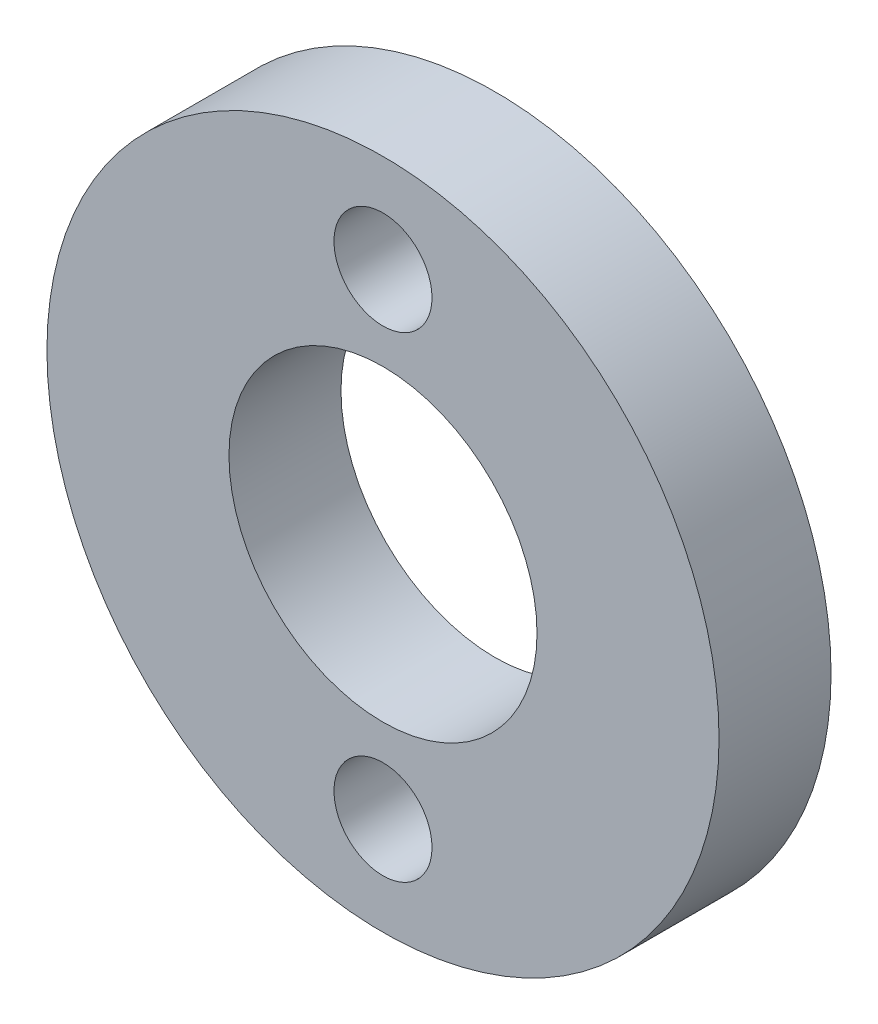
ISO-10303-21;
HEADER;
FILE_DESCRIPTION(('STEP AP214'),'2;1');
FILE_NAME('part.step','',(''),(''),'','','');
FILE_SCHEMA(('AUTOMOTIVE_DESIGN { 1 0 10303 214 1 1 1 1 }'));
ENDSEC;
DATA;
#1=APPLICATION_CONTEXT('core data for automotive mechanical design processes');
#2=APPLICATION_PROTOCOL_DEFINITION('international standard','automotive_design',2000,#1);
#3=PRODUCT_CONTEXT('',#1,'mechanical');
#4=PRODUCT('Part','Part','',(#3));
#5=PRODUCT_RELATED_PRODUCT_CATEGORY('part','',(#4));
#6=PRODUCT_DEFINITION_FORMATION('','',#4);
#7=PRODUCT_DEFINITION_CONTEXT('part definition',#1,'design');
#8=PRODUCT_DEFINITION('design','',#6,#7);
#9=PRODUCT_DEFINITION_SHAPE('','',#8);
#10=(LENGTH_UNIT() NAMED_UNIT(*) SI_UNIT(.MILLI.,.METRE.));
#11=(NAMED_UNIT(*) PLANE_ANGLE_UNIT() SI_UNIT($,.RADIAN.));
#12=(NAMED_UNIT(*) SI_UNIT($,.STERADIAN.) SOLID_ANGLE_UNIT());
#13=UNCERTAINTY_MEASURE_WITH_UNIT(LENGTH_MEASURE(1.E-05),#10,'distance_accuracy_value','');
#14=(GEOMETRIC_REPRESENTATION_CONTEXT(3) GLOBAL_UNCERTAINTY_ASSIGNED_CONTEXT((#13)) GLOBAL_UNIT_ASSIGNED_CONTEXT((#10,
#11,#12)) REPRESENTATION_CONTEXT('',''));
#15=CARTESIAN_POINT('',(0.,0.,0.));
#16=DIRECTION('',(0.,0.,1.));
#17=DIRECTION('',(1.,0.,0.));
#18=AXIS2_PLACEMENT_3D('',#15,#16,#17);
#19=CARTESIAN_POINT('',(0.,0.,4.));
#20=DIRECTION('',(0.,0.,1.));
#21=DIRECTION('',(1.,0.,0.));
#22=AXIS2_PLACEMENT_3D('',#19,#20,#21);
#23=PLANE('',#22);
#24=CARTESIAN_POINT('',(0.,8.5,4.));
#25=DIRECTION('',(0.,0.,1.));
#26=DIRECTION('',(1.,0.,0.));
#27=AXIS2_PLACEMENT_3D('',#24,#25,#26);
#28=CIRCLE('',#27,1.75);
#29=CARTESIAN_POINT('',(1.75,8.5,4.));
#30=VERTEX_POINT('',#29);
#31=EDGE_CURVE('E58',#30,#30,#28,.T.);
#32=ORIENTED_EDGE('',*,*,#31,.F.);
#33=EDGE_LOOP('',(#32));
#34=FACE_BOUND('',#33,.T.);
#35=CARTESIAN_POINT('',(0.,0.,4.));
#36=DIRECTION('',(0.,0.,1.));
#37=DIRECTION('',(1.,0.,0.));
#38=AXIS2_PLACEMENT_3D('',#35,#36,#37);
#39=CIRCLE('',#38,12.);
#40=CARTESIAN_POINT('',(12.,0.,4.));
#41=VERTEX_POINT('',#40);
#42=EDGE_CURVE('E12',#41,#41,#39,.T.);
#43=ORIENTED_EDGE('',*,*,#42,.T.);
#44=EDGE_LOOP('',(#43));
#45=FACE_BOUND('',#44,.T.);
#46=CARTESIAN_POINT('',(0.,0.,4.));
#47=DIRECTION('',(0.,0.,1.));
#48=DIRECTION('',(1.,0.,0.));
#49=AXIS2_PLACEMENT_3D('',#46,#47,#48);
#50=CIRCLE('',#49,5.5);
#51=CARTESIAN_POINT('',(5.5,0.,4.));
#52=VERTEX_POINT('',#51);
#53=EDGE_CURVE('E53',#52,#52,#50,.T.);
#54=ORIENTED_EDGE('',*,*,#53,.F.);
#55=EDGE_LOOP('',(#54));
#56=FACE_BOUND('',#55,.T.);
#57=CARTESIAN_POINT('',(0.,-8.5,4.));
#58=DIRECTION('',(0.,0.,1.));
#59=DIRECTION('',(1.,0.,0.));
#60=AXIS2_PLACEMENT_3D('',#57,#58,#59);
#61=CIRCLE('',#60,1.75);
#62=CARTESIAN_POINT('',(1.75,-8.5,4.));
#63=VERTEX_POINT('',#62);
#64=EDGE_CURVE('E64',#63,#63,#61,.T.);
#65=ORIENTED_EDGE('',*,*,#64,.F.);
#66=EDGE_LOOP('',(#65));
#67=FACE_BOUND('',#66,.T.);
#68=ADVANCED_FACE('F42',(#34,#45,#56,#67),#23,.T.);
#69=CARTESIAN_POINT('',(0.,0.,0.));
#70=DIRECTION('',(0.,0.,1.));
#71=DIRECTION('',(1.,0.,0.));
#72=AXIS2_PLACEMENT_3D('',#69,#70,#71);
#73=PLANE('',#72);
#74=CARTESIAN_POINT('',(0.,0.,0.));
#75=DIRECTION('',(0.,0.,1.));
#76=DIRECTION('',(1.,0.,0.));
#77=AXIS2_PLACEMENT_3D('',#74,#75,#76);
#78=CIRCLE('',#77,12.);
#79=CARTESIAN_POINT('',(12.,0.,0.));
#80=VERTEX_POINT('',#79);
#81=EDGE_CURVE('E46',#80,#80,#78,.T.);
#82=ORIENTED_EDGE('',*,*,#81,.F.);
#83=EDGE_LOOP('',(#82));
#84=FACE_BOUND('',#83,.T.);
#85=CARTESIAN_POINT('',(0.,0.,0.));
#86=DIRECTION('',(0.,0.,1.));
#87=DIRECTION('',(1.,0.,0.));
#88=AXIS2_PLACEMENT_3D('',#85,#86,#87);
#89=CIRCLE('',#88,5.5);
#90=CARTESIAN_POINT('',(5.5,0.,0.));
#91=VERTEX_POINT('',#90);
#92=EDGE_CURVE('E55',#91,#91,#89,.T.);
#93=ORIENTED_EDGE('',*,*,#92,.T.);
#94=EDGE_LOOP('',(#93));
#95=FACE_BOUND('',#94,.T.);
#96=CARTESIAN_POINT('',(0.,8.5,0.));
#97=DIRECTION('',(0.,0.,1.));
#98=DIRECTION('',(1.,0.,0.));
#99=AXIS2_PLACEMENT_3D('',#96,#97,#98);
#100=CIRCLE('',#99,1.75);
#101=CARTESIAN_POINT('',(1.75,8.5,0.));
#102=VERTEX_POINT('',#101);
#103=EDGE_CURVE('E61',#102,#102,#100,.T.);
#104=ORIENTED_EDGE('',*,*,#103,.T.);
#105=EDGE_LOOP('',(#104));
#106=FACE_BOUND('',#105,.T.);
#107=CARTESIAN_POINT('',(0.,-8.5,0.));
#108=DIRECTION('',(0.,0.,1.));
#109=DIRECTION('',(1.,0.,0.));
#110=AXIS2_PLACEMENT_3D('',#107,#108,#109);
#111=CIRCLE('',#110,1.75);
#112=CARTESIAN_POINT('',(1.75,-8.5,0.));
#113=VERTEX_POINT('',#112);
#114=EDGE_CURVE('E67',#113,#113,#111,.T.);
#115=ORIENTED_EDGE('',*,*,#114,.T.);
#116=EDGE_LOOP('',(#115));
#117=FACE_BOUND('',#116,.T.);
#118=ADVANCED_FACE('F77',(#84,#95,#106,#117),#73,.F.);
#119=CARTESIAN_POINT('',(0.,0.,4.));
#120=DIRECTION('',(0.,0.,-1.));
#121=DIRECTION('',(-1.,0.,0.));
#122=AXIS2_PLACEMENT_3D('',#119,#120,#121);
#123=CYLINDRICAL_SURFACE('',#122,12.);
#124=ORIENTED_EDGE('',*,*,#42,.F.);
#125=EDGE_LOOP('',(#124));
#126=FACE_BOUND('',#125,.T.);
#127=ORIENTED_EDGE('',*,*,#81,.T.);
#128=EDGE_LOOP('',(#127));
#129=FACE_BOUND('',#128,.T.);
#130=ADVANCED_FACE('F44',(#126,#129),#123,.T.);
#131=CARTESIAN_POINT('',(0.,0.,4.));
#132=DIRECTION('',(0.,0.,-1.));
#133=DIRECTION('',(-1.,0.,0.));
#134=AXIS2_PLACEMENT_3D('',#131,#132,#133);
#135=CYLINDRICAL_SURFACE('',#134,5.5);
#136=ORIENTED_EDGE('',*,*,#53,.T.);
#137=EDGE_LOOP('',(#136));
#138=FACE_BOUND('',#137,.T.);
#139=ORIENTED_EDGE('',*,*,#92,.F.);
#140=EDGE_LOOP('',(#139));
#141=FACE_BOUND('',#140,.T.);
#142=ADVANCED_FACE('F86',(#138,#141),#135,.F.);
#143=CARTESIAN_POINT('',(0.,8.5,4.));
#144=DIRECTION('',(0.,0.,-1.));
#145=DIRECTION('',(-1.,0.,0.));
#146=AXIS2_PLACEMENT_3D('',#143,#144,#145);
#147=CYLINDRICAL_SURFACE('',#146,1.75);
#148=ORIENTED_EDGE('',*,*,#31,.T.);
#149=EDGE_LOOP('',(#148));
#150=FACE_BOUND('',#149,.T.);
#151=ORIENTED_EDGE('',*,*,#103,.F.);
#152=EDGE_LOOP('',(#151));
#153=FACE_BOUND('',#152,.T.);
#154=ADVANCED_FACE('F89',(#150,#153),#147,.F.);
#155=CARTESIAN_POINT('',(0.,-8.5,4.));
#156=DIRECTION('',(0.,0.,-1.));
#157=DIRECTION('',(-1.,0.,0.));
#158=AXIS2_PLACEMENT_3D('',#155,#156,#157);
#159=CYLINDRICAL_SURFACE('',#158,1.75);
#160=ORIENTED_EDGE('',*,*,#64,.T.);
#161=EDGE_LOOP('',(#160));
#162=FACE_BOUND('',#161,.T.);
#163=ORIENTED_EDGE('',*,*,#114,.F.);
#164=EDGE_LOOP('',(#163));
#165=FACE_BOUND('',#164,.T.);
#166=ADVANCED_FACE('F73',(#162,#165),#159,.F.);
#167=CLOSED_SHELL('',(#68,#118,#130,#142,#154,#166));
#168=MANIFOLD_SOLID_BREP('B2',#167);
#169=ADVANCED_BREP_SHAPE_REPRESENTATION('',(#18,#168),#14);
#170=SHAPE_DEFINITION_REPRESENTATION(#9,#169);
ENDSEC;
END-ISO-10303-21;
